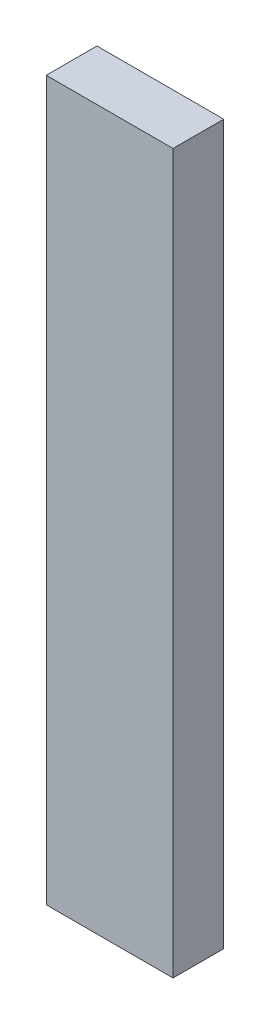
ISO-10303-21;
HEADER;
FILE_DESCRIPTION(('STEP AP214'),'2;1');
FILE_NAME('part.step','',(''),(''),'','','');
FILE_SCHEMA(('AUTOMOTIVE_DESIGN { 1 0 10303 214 1 1 1 1 }'));
ENDSEC;
DATA;
#1=APPLICATION_CONTEXT('core data for automotive mechanical design processes');
#2=APPLICATION_PROTOCOL_DEFINITION('international standard','automotive_design',2000,#1);
#3=PRODUCT_CONTEXT('',#1,'mechanical');
#4=PRODUCT('Part','Part','',(#3));
#5=PRODUCT_RELATED_PRODUCT_CATEGORY('part','',(#4));
#6=PRODUCT_DEFINITION_FORMATION('','',#4);
#7=PRODUCT_DEFINITION_CONTEXT('part definition',#1,'design');
#8=PRODUCT_DEFINITION('design','',#6,#7);
#9=PRODUCT_DEFINITION_SHAPE('','',#8);
#10=(LENGTH_UNIT() NAMED_UNIT(*) SI_UNIT(.MILLI.,.METRE.));
#11=(NAMED_UNIT(*) PLANE_ANGLE_UNIT() SI_UNIT($,.RADIAN.));
#12=(NAMED_UNIT(*) SI_UNIT($,.STERADIAN.) SOLID_ANGLE_UNIT());
#13=UNCERTAINTY_MEASURE_WITH_UNIT(LENGTH_MEASURE(1.E-05),#10,'distance_accuracy_value','');
#14=(GEOMETRIC_REPRESENTATION_CONTEXT(3) GLOBAL_UNCERTAINTY_ASSIGNED_CONTEXT((#13)) GLOBAL_UNIT_ASSIGNED_CONTEXT((#10,
#11,#12)) REPRESENTATION_CONTEXT('',''));
#15=CARTESIAN_POINT('',(0.,0.,0.));
#16=DIRECTION('',(0.,0.,1.));
#17=DIRECTION('',(1.,0.,0.));
#18=AXIS2_PLACEMENT_3D('',#15,#16,#17);
#19=CARTESIAN_POINT('',(-7.50000000000001,42.5,6.));
#20=DIRECTION('',(1.,0.,0.));
#21=DIRECTION('',(0.,1.,0.));
#22=AXIS2_PLACEMENT_3D('',#19,#20,#21);
#23=PLANE('',#22);
#24=DIRECTION('',(0.,-1.,0.));
#25=VECTOR('',#24,1.);
#26=CARTESIAN_POINT('',(-7.50000000000001,42.5,0.));
#27=LINE('',#26,#25);
#28=CARTESIAN_POINT('',(-7.50000000000001,42.5,0.));
#29=VERTEX_POINT('',#28);
#30=CARTESIAN_POINT('',(-7.49999999999999,-42.5,0.));
#31=VERTEX_POINT('',#30);
#32=EDGE_CURVE('E96',#29,#31,#27,.T.);
#33=ORIENTED_EDGE('',*,*,#32,.T.);
#34=DIRECTION('',(0.,0.,-1.));
#35=VECTOR('',#34,1.);
#36=CARTESIAN_POINT('',(-7.49999999999999,-42.5,6.));
#37=LINE('',#36,#35);
#38=CARTESIAN_POINT('',(-7.49999999999999,-42.5,6.));
#39=VERTEX_POINT('',#38);
#40=EDGE_CURVE('E11',#39,#31,#37,.T.);
#41=ORIENTED_EDGE('',*,*,#40,.F.);
#42=DIRECTION('',(0.,-1.,0.));
#43=VECTOR('',#42,1.);
#44=CARTESIAN_POINT('',(-7.50000000000001,42.5,6.));
#45=LINE('',#44,#43);
#46=CARTESIAN_POINT('',(-7.50000000000001,42.5,6.));
#47=VERTEX_POINT('',#46);
#48=EDGE_CURVE('E84',#47,#39,#45,.T.);
#49=ORIENTED_EDGE('',*,*,#48,.F.);
#50=DIRECTION('',(0.,0.,-1.));
#51=VECTOR('',#50,1.);
#52=CARTESIAN_POINT('',(-7.50000000000001,42.5,6.));
#53=LINE('',#52,#51);
#54=EDGE_CURVE('E92',#47,#29,#53,.T.);
#55=ORIENTED_EDGE('',*,*,#54,.T.);
#56=EDGE_LOOP('',(#33,#41,#49,#55));
#57=FACE_BOUND('',#56,.T.);
#58=ADVANCED_FACE('F33',(#57),#23,.F.);
#59=CARTESIAN_POINT('',(-7.49999999999999,-42.5,6.));
#60=DIRECTION('',(0.,1.,0.));
#61=DIRECTION('',(0.,0.,1.));
#62=AXIS2_PLACEMENT_3D('',#59,#60,#61);
#63=PLANE('',#62);
#64=DIRECTION('',(1.,0.,0.));
#65=VECTOR('',#64,1.);
#66=CARTESIAN_POINT('',(-7.49999999999999,-42.5,0.));
#67=LINE('',#66,#65);
#68=CARTESIAN_POINT('',(7.50000000000001,-42.5,0.));
#69=VERTEX_POINT('',#68);
#70=EDGE_CURVE('E88',#31,#69,#67,.T.);
#71=ORIENTED_EDGE('',*,*,#70,.T.);
#72=DIRECTION('',(0.,0.,-1.));
#73=VECTOR('',#72,1.);
#74=CARTESIAN_POINT('',(7.50000000000001,-42.5,6.));
#75=LINE('',#74,#73);
#76=CARTESIAN_POINT('',(7.50000000000001,-42.5,6.));
#77=VERTEX_POINT('',#76);
#78=EDGE_CURVE('E41',#77,#69,#75,.T.);
#79=ORIENTED_EDGE('',*,*,#78,.F.);
#80=DIRECTION('',(1.,0.,0.));
#81=VECTOR('',#80,1.);
#82=CARTESIAN_POINT('',(-7.49999999999999,-42.5,6.));
#83=LINE('',#82,#81);
#84=EDGE_CURVE('E79',#39,#77,#83,.T.);
#85=ORIENTED_EDGE('',*,*,#84,.F.);
#86=ORIENTED_EDGE('',*,*,#40,.T.);
#87=EDGE_LOOP('',(#71,#79,#85,#86));
#88=FACE_BOUND('',#87,.T.);
#89=ADVANCED_FACE('F87',(#88),#63,.F.);
#90=CARTESIAN_POINT('',(7.49999999999999,42.5,6.));
#91=DIRECTION('',(-1.,0.,0.));
#92=DIRECTION('',(0.,-1.,0.));
#93=AXIS2_PLACEMENT_3D('',#90,#91,#92);
#94=PLANE('',#93);
#95=DIRECTION('',(0.,1.,0.));
#96=VECTOR('',#95,1.);
#97=CARTESIAN_POINT('',(7.49999999999999,42.5,0.));
#98=LINE('',#97,#96);
#99=CARTESIAN_POINT('',(7.49999999999999,42.5,0.));
#100=VERTEX_POINT('',#99);
#101=EDGE_CURVE('E66',#69,#100,#98,.T.);
#102=ORIENTED_EDGE('',*,*,#101,.T.);
#103=DIRECTION('',(0.,0.,-1.));
#104=VECTOR('',#103,1.);
#105=CARTESIAN_POINT('',(7.49999999999999,42.5,6.));
#106=LINE('',#105,#104);
#107=CARTESIAN_POINT('',(7.49999999999999,42.5,6.));
#108=VERTEX_POINT('',#107);
#109=EDGE_CURVE('E89',#108,#100,#106,.T.);
#110=ORIENTED_EDGE('',*,*,#109,.F.);
#111=DIRECTION('',(0.,1.,0.));
#112=VECTOR('',#111,1.);
#113=CARTESIAN_POINT('',(7.49999999999999,42.5,6.));
#114=LINE('',#113,#112);
#115=EDGE_CURVE('E82',#77,#108,#114,.T.);
#116=ORIENTED_EDGE('',*,*,#115,.F.);
#117=ORIENTED_EDGE('',*,*,#78,.T.);
#118=EDGE_LOOP('',(#102,#110,#116,#117));
#119=FACE_BOUND('',#118,.T.);
#120=ADVANCED_FACE('F90',(#119),#94,.F.);
#121=CARTESIAN_POINT('',(-7.50000000000001,42.5,6.));
#122=DIRECTION('',(0.,-1.,0.));
#123=DIRECTION('',(0.,0.,-1.));
#124=AXIS2_PLACEMENT_3D('',#121,#122,#123);
#125=PLANE('',#124);
#126=DIRECTION('',(-1.,0.,0.));
#127=VECTOR('',#126,1.);
#128=CARTESIAN_POINT('',(-7.50000000000001,42.5,0.));
#129=LINE('',#128,#127);
#130=EDGE_CURVE('E72',#100,#29,#129,.T.);
#131=ORIENTED_EDGE('',*,*,#130,.T.);
#132=ORIENTED_EDGE('',*,*,#54,.F.);
#133=DIRECTION('',(-1.,0.,0.));
#134=VECTOR('',#133,1.);
#135=CARTESIAN_POINT('',(-7.50000000000001,42.5,6.));
#136=LINE('',#135,#134);
#137=EDGE_CURVE('E49',#108,#47,#136,.T.);
#138=ORIENTED_EDGE('',*,*,#137,.F.);
#139=ORIENTED_EDGE('',*,*,#109,.T.);
#140=EDGE_LOOP('',(#131,#132,#138,#139));
#141=FACE_BOUND('',#140,.T.);
#142=ADVANCED_FACE('F103',(#141),#125,.F.);
#143=CARTESIAN_POINT('',(0.,0.,6.));
#144=DIRECTION('',(0.,0.,1.));
#145=DIRECTION('',(1.,0.,0.));
#146=AXIS2_PLACEMENT_3D('',#143,#144,#145);
#147=PLANE('',#146);
#148=ORIENTED_EDGE('',*,*,#48,.T.);
#149=ORIENTED_EDGE('',*,*,#84,.T.);
#150=ORIENTED_EDGE('',*,*,#115,.T.);
#151=ORIENTED_EDGE('',*,*,#137,.T.);
#152=EDGE_LOOP('',(#148,#149,#150,#151));
#153=FACE_BOUND('',#152,.T.);
#154=ADVANCED_FACE('F80',(#153),#147,.T.);
#155=CARTESIAN_POINT('',(0.,0.,0.));
#156=DIRECTION('',(0.,0.,1.));
#157=DIRECTION('',(1.,0.,0.));
#158=AXIS2_PLACEMENT_3D('',#155,#156,#157);
#159=PLANE('',#158);
#160=ORIENTED_EDGE('',*,*,#32,.F.);
#161=ORIENTED_EDGE('',*,*,#130,.F.);
#162=ORIENTED_EDGE('',*,*,#101,.F.);
#163=ORIENTED_EDGE('',*,*,#70,.F.);
#164=EDGE_LOOP('',(#160,#161,#162,#163));
#165=FACE_BOUND('',#164,.T.);
#166=ADVANCED_FACE('F106',(#165),#159,.F.);
#167=CLOSED_SHELL('',(#58,#89,#120,#142,#154,#166));
#168=MANIFOLD_SOLID_BREP('B2',#167);
#169=ADVANCED_BREP_SHAPE_REPRESENTATION('',(#18,#168),#14);
#170=SHAPE_DEFINITION_REPRESENTATION(#9,#169);
ENDSEC;
END-ISO-10303-21;
